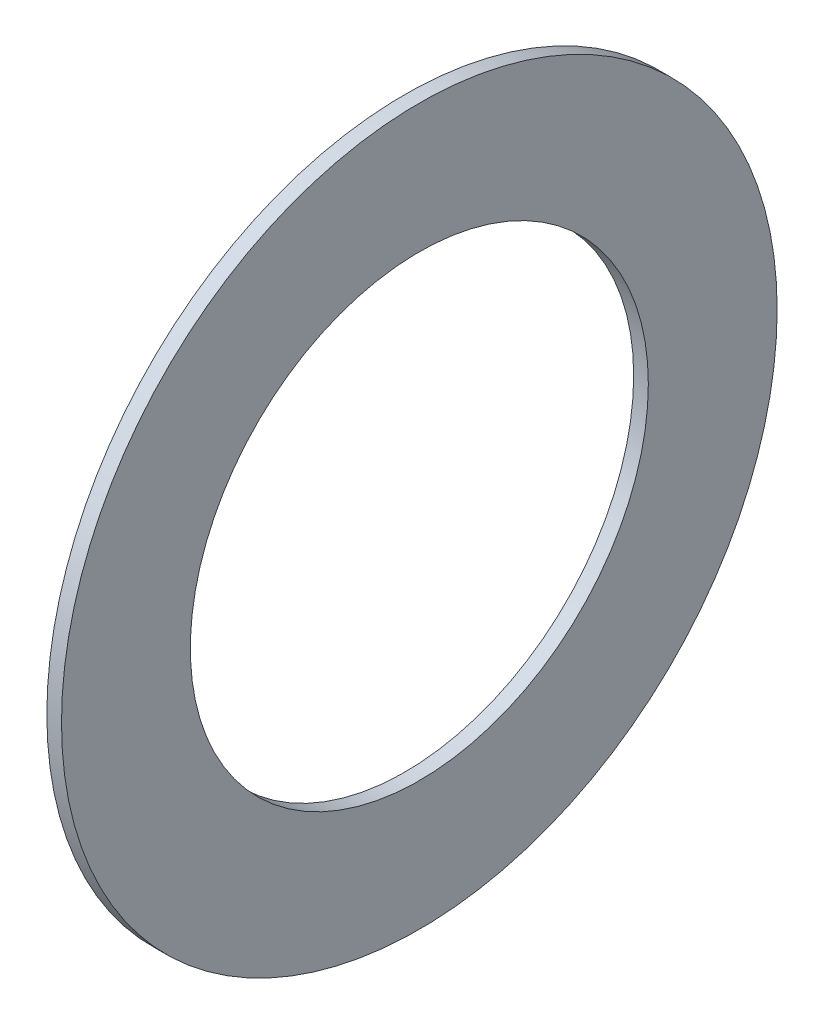
ISO-10303-21;
HEADER;
FILE_DESCRIPTION(('STEP AP214'),'2;1');
FILE_NAME('part.step','',(''),(''),'','','');
FILE_SCHEMA(('AUTOMOTIVE_DESIGN { 1 0 10303 214 1 1 1 1 }'));
ENDSEC;
DATA;
#1=APPLICATION_CONTEXT('core data for automotive mechanical design processes');
#2=APPLICATION_PROTOCOL_DEFINITION('international standard','automotive_design',2000,#1);
#3=PRODUCT_CONTEXT('',#1,'mechanical');
#4=PRODUCT('Part','Part','',(#3));
#5=PRODUCT_RELATED_PRODUCT_CATEGORY('part','',(#4));
#6=PRODUCT_DEFINITION_FORMATION('','',#4);
#7=PRODUCT_DEFINITION_CONTEXT('part definition',#1,'design');
#8=PRODUCT_DEFINITION('design','',#6,#7);
#9=PRODUCT_DEFINITION_SHAPE('','',#8);
#10=(LENGTH_UNIT() NAMED_UNIT(*) SI_UNIT(.MILLI.,.METRE.));
#11=(NAMED_UNIT(*) PLANE_ANGLE_UNIT() SI_UNIT($,.RADIAN.));
#12=(NAMED_UNIT(*) SI_UNIT($,.STERADIAN.) SOLID_ANGLE_UNIT());
#13=UNCERTAINTY_MEASURE_WITH_UNIT(LENGTH_MEASURE(1.E-05),#10,'distance_accuracy_value','');
#14=(GEOMETRIC_REPRESENTATION_CONTEXT(3) GLOBAL_UNCERTAINTY_ASSIGNED_CONTEXT((#13)) GLOBAL_UNIT_ASSIGNED_CONTEXT((#10,
#11,#12)) REPRESENTATION_CONTEXT('',''));
#15=CARTESIAN_POINT('',(0.,0.,0.));
#16=DIRECTION('',(0.,0.,1.));
#17=DIRECTION('',(1.,0.,0.));
#18=AXIS2_PLACEMENT_3D('',#15,#16,#17);
#19=CARTESIAN_POINT('',(0.8128,0.,0.));
#20=DIRECTION('',(1.,0.,0.));
#21=DIRECTION('',(0.,0.,-1.));
#22=AXIS2_PLACEMENT_3D('',#19,#20,#21);
#23=PLANE('',#22);
#24=CARTESIAN_POINT('',(0.8128,0.,0.));
#25=DIRECTION('',(1.,0.,0.));
#26=DIRECTION('',(0.,0.,-1.));
#27=AXIS2_PLACEMENT_3D('',#24,#25,#26);
#28=CIRCLE('',#27,19.84375);
#29=CARTESIAN_POINT('',(0.8128,0.,-19.84375));
#30=VERTEX_POINT('',#29);
#31=EDGE_CURVE('E10',#30,#30,#28,.T.);
#32=ORIENTED_EDGE('',*,*,#31,.T.);
#33=EDGE_LOOP('',(#32));
#34=FACE_BOUND('',#33,.T.);
#35=CARTESIAN_POINT('',(0.8128,0.,0.));
#36=DIRECTION('',(1.,0.,0.));
#37=DIRECTION('',(0.,0.,-1.));
#38=AXIS2_PLACEMENT_3D('',#35,#36,#37);
#39=CIRCLE('',#38,12.7);
#40=CARTESIAN_POINT('',(0.8128,0.,-12.7));
#41=VERTEX_POINT('',#40);
#42=EDGE_CURVE('E45',#41,#41,#39,.T.);
#43=ORIENTED_EDGE('',*,*,#42,.F.);
#44=EDGE_LOOP('',(#43));
#45=FACE_BOUND('',#44,.T.);
#46=ADVANCED_FACE('F34',(#34,#45),#23,.T.);
#47=CARTESIAN_POINT('',(0.,0.,0.));
#48=DIRECTION('',(1.,0.,0.));
#49=DIRECTION('',(0.,0.,-1.));
#50=AXIS2_PLACEMENT_3D('',#47,#48,#49);
#51=PLANE('',#50);
#52=CARTESIAN_POINT('',(0.,0.,0.));
#53=DIRECTION('',(1.,0.,0.));
#54=DIRECTION('',(0.,0.,-1.));
#55=AXIS2_PLACEMENT_3D('',#52,#53,#54);
#56=CIRCLE('',#55,19.84375);
#57=CARTESIAN_POINT('',(0.,0.,-19.84375));
#58=VERTEX_POINT('',#57);
#59=EDGE_CURVE('E41',#58,#58,#56,.T.);
#60=ORIENTED_EDGE('',*,*,#59,.F.);
#61=EDGE_LOOP('',(#60));
#62=FACE_BOUND('',#61,.T.);
#63=CARTESIAN_POINT('',(0.,0.,0.));
#64=DIRECTION('',(1.,0.,0.));
#65=DIRECTION('',(0.,0.,-1.));
#66=AXIS2_PLACEMENT_3D('',#63,#64,#65);
#67=CIRCLE('',#66,12.7);
#68=CARTESIAN_POINT('',(0.,0.,-12.7));
#69=VERTEX_POINT('',#68);
#70=EDGE_CURVE('E49',#69,#69,#67,.T.);
#71=ORIENTED_EDGE('',*,*,#70,.T.);
#72=EDGE_LOOP('',(#71));
#73=FACE_BOUND('',#72,.T.);
#74=ADVANCED_FACE('F55',(#62,#73),#51,.F.);
#75=CARTESIAN_POINT('',(0.8128,0.,0.));
#76=DIRECTION('',(-1.,0.,0.));
#77=DIRECTION('',(0.,0.,1.));
#78=AXIS2_PLACEMENT_3D('',#75,#76,#77);
#79=CYLINDRICAL_SURFACE('',#78,19.84375);
#80=ORIENTED_EDGE('',*,*,#31,.F.);
#81=EDGE_LOOP('',(#80));
#82=FACE_BOUND('',#81,.T.);
#83=ORIENTED_EDGE('',*,*,#59,.T.);
#84=EDGE_LOOP('',(#83));
#85=FACE_BOUND('',#84,.T.);
#86=ADVANCED_FACE('F36',(#82,#85),#79,.T.);
#87=CARTESIAN_POINT('',(0.8128,0.,0.));
#88=DIRECTION('',(-1.,0.,0.));
#89=DIRECTION('',(0.,0.,1.));
#90=AXIS2_PLACEMENT_3D('',#87,#88,#89);
#91=CYLINDRICAL_SURFACE('',#90,12.7);
#92=ORIENTED_EDGE('',*,*,#42,.T.);
#93=EDGE_LOOP('',(#92));
#94=FACE_BOUND('',#93,.T.);
#95=ORIENTED_EDGE('',*,*,#70,.F.);
#96=EDGE_LOOP('',(#95));
#97=FACE_BOUND('',#96,.T.);
#98=ADVANCED_FACE('F57',(#94,#97),#91,.F.);
#99=CLOSED_SHELL('',(#46,#74,#86,#98));
#100=MANIFOLD_SOLID_BREP('B2',#99);
#101=ADVANCED_BREP_SHAPE_REPRESENTATION('',(#18,#100),#14);
#102=SHAPE_DEFINITION_REPRESENTATION(#9,#101);
ENDSEC;
END-ISO-10303-21;
